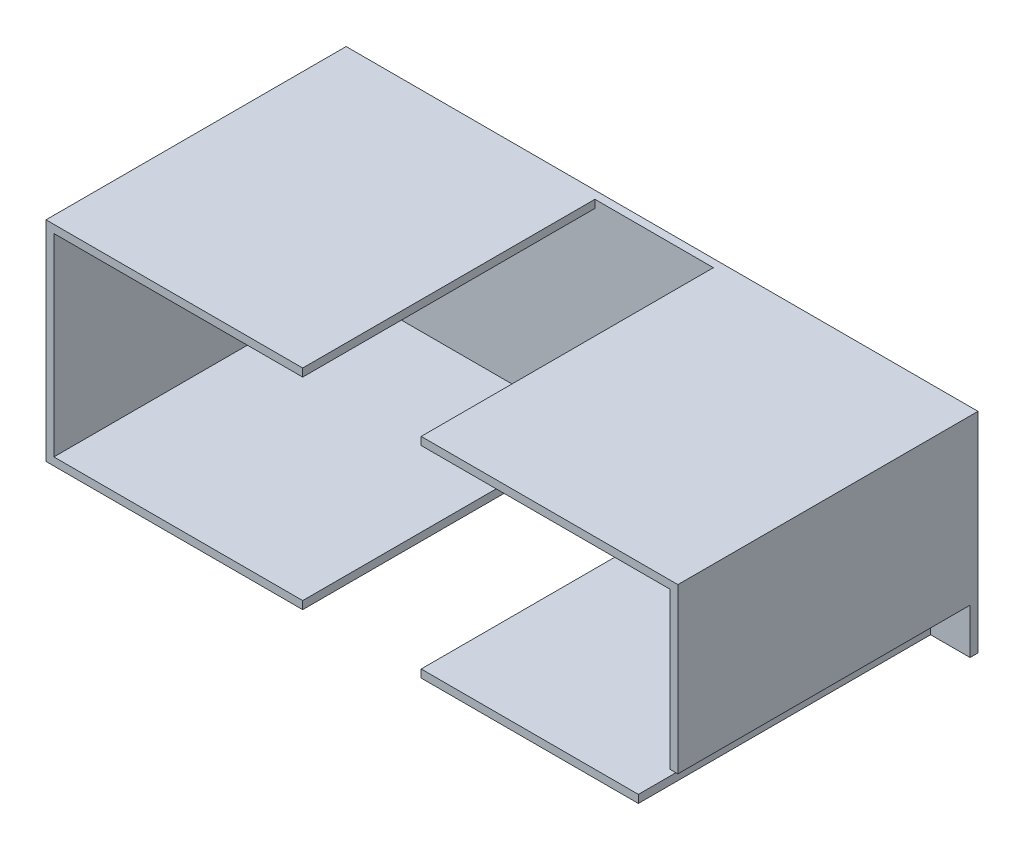
ISO-10303-21;
HEADER;
FILE_DESCRIPTION(('STEP AP214'),'2;1');
FILE_NAME('part.step','',(''),(''),'','','');
FILE_SCHEMA(('AUTOMOTIVE_DESIGN { 1 0 10303 214 1 1 1 1 }'));
ENDSEC;
DATA;
#1=APPLICATION_CONTEXT('core data for automotive mechanical design processes');
#2=APPLICATION_PROTOCOL_DEFINITION('international standard','automotive_design',2000,#1);
#3=PRODUCT_CONTEXT('',#1,'mechanical');
#4=PRODUCT('Part','Part','',(#3));
#5=PRODUCT_RELATED_PRODUCT_CATEGORY('part','',(#4));
#6=PRODUCT_DEFINITION_FORMATION('','',#4);
#7=PRODUCT_DEFINITION_CONTEXT('part definition',#1,'design');
#8=PRODUCT_DEFINITION('design','',#6,#7);
#9=PRODUCT_DEFINITION_SHAPE('','',#8);
#10=(LENGTH_UNIT() NAMED_UNIT(*) SI_UNIT(.MILLI.,.METRE.));
#11=(NAMED_UNIT(*) PLANE_ANGLE_UNIT() SI_UNIT($,.RADIAN.));
#12=(NAMED_UNIT(*) SI_UNIT($,.STERADIAN.) SOLID_ANGLE_UNIT());
#13=UNCERTAINTY_MEASURE_WITH_UNIT(LENGTH_MEASURE(1.E-05),#10,'distance_accuracy_value','');
#14=(GEOMETRIC_REPRESENTATION_CONTEXT(3) GLOBAL_UNCERTAINTY_ASSIGNED_CONTEXT((#13)) GLOBAL_UNIT_ASSIGNED_CONTEXT((#10,
#11,#12)) REPRESENTATION_CONTEXT('',''));
#15=CARTESIAN_POINT('',(0.,0.,0.));
#16=DIRECTION('',(0.,0.,1.));
#17=DIRECTION('',(1.,0.,0.));
#18=AXIS2_PLACEMENT_3D('',#15,#16,#17);
#19=CARTESIAN_POINT('',(0.,0.,76.));
#20=DIRECTION('',(0.,0.,-1.));
#21=DIRECTION('',(-1.,0.,0.));
#22=AXIS2_PLACEMENT_3D('',#19,#20,#21);
#23=PLANE('',#22);
#24=DIRECTION('',(-1.,0.,0.));
#25=VECTOR('',#24,1.);
#26=CARTESIAN_POINT('',(78.,24.5,76.));
#27=LINE('',#26,#25);
#28=CARTESIAN_POINT('',(-15.,24.5,76.));
#29=VERTEX_POINT('',#28);
#30=CARTESIAN_POINT('',(-78.,24.5,76.));
#31=VERTEX_POINT('',#30);
#32=EDGE_CURVE('E256',#29,#31,#27,.T.);
#33=ORIENTED_EDGE('',*,*,#32,.F.);
#34=DIRECTION('',(0.,-1.,0.));
#35=VECTOR('',#34,1.);
#36=CARTESIAN_POINT('',(-15.,24.5,76.));
#37=LINE('',#36,#35);
#38=CARTESIAN_POINT('',(-15.,26.5,76.));
#39=VERTEX_POINT('',#38);
#40=EDGE_CURVE('E183',#39,#29,#37,.T.);
#41=ORIENTED_EDGE('',*,*,#40,.F.);
#42=DIRECTION('',(-1.,0.,0.));
#43=VECTOR('',#42,1.);
#44=CARTESIAN_POINT('',(-80.,26.5,76.));
#45=LINE('',#44,#43);
#46=CARTESIAN_POINT('',(-80.,26.5,76.));
#47=VERTEX_POINT('',#46);
#48=EDGE_CURVE('E188',#39,#47,#45,.T.);
#49=ORIENTED_EDGE('',*,*,#48,.T.);
#50=DIRECTION('',(0.,-1.,0.));
#51=VECTOR('',#50,1.);
#52=CARTESIAN_POINT('',(-80.,-26.5,76.));
#53=LINE('',#52,#51);
#54=CARTESIAN_POINT('',(-80.,-26.5,76.));
#55=VERTEX_POINT('',#54);
#56=EDGE_CURVE('E289',#47,#55,#53,.T.);
#57=ORIENTED_EDGE('',*,*,#56,.T.);
#58=DIRECTION('',(1.,0.,0.));
#59=VECTOR('',#58,1.);
#60=CARTESIAN_POINT('',(-80.,-26.5,76.));
#61=LINE('',#60,#59);
#62=CARTESIAN_POINT('',(-15.,-26.5,76.));
#63=VERTEX_POINT('',#62);
#64=EDGE_CURVE('E292',#55,#63,#61,.T.);
#65=ORIENTED_EDGE('',*,*,#64,.T.);
#66=DIRECTION('',(0.,-1.,0.));
#67=VECTOR('',#66,1.);
#68=CARTESIAN_POINT('',(-15.,-26.5,76.));
#69=LINE('',#68,#67);
#70=CARTESIAN_POINT('',(-15.,-24.5,76.));
#71=VERTEX_POINT('',#70);
#72=EDGE_CURVE('E196',#71,#63,#69,.T.);
#73=ORIENTED_EDGE('',*,*,#72,.F.);
#74=DIRECTION('',(1.,0.,0.));
#75=VECTOR('',#74,1.);
#76=CARTESIAN_POINT('',(-78.,-24.5,76.));
#77=LINE('',#76,#75);
#78=CARTESIAN_POINT('',(-78.,-24.5,76.));
#79=VERTEX_POINT('',#78);
#80=EDGE_CURVE('E259',#79,#71,#77,.T.);
#81=ORIENTED_EDGE('',*,*,#80,.F.);
#82=DIRECTION('',(0.,-1.,0.));
#83=VECTOR('',#82,1.);
#84=CARTESIAN_POINT('',(-78.,24.5,76.));
#85=LINE('',#84,#83);
#86=EDGE_CURVE('E250',#31,#79,#85,.T.);
#87=ORIENTED_EDGE('',*,*,#86,.F.);
#88=EDGE_LOOP('',(#33,#41,#49,#57,#65,#73,#81,#87));
#89=FACE_BOUND('',#88,.T.);
#90=ADVANCED_FACE('F34',(#89),#23,.F.);
#91=CARTESIAN_POINT('',(80.,26.5,76.));
#92=VERTEX_POINT('',#91);
#93=CARTESIAN_POINT('',(15.,26.5,76.));
#94=VERTEX_POINT('',#93);
#95=EDGE_CURVE('E286',#92,#94,#45,.T.);
#96=ORIENTED_EDGE('',*,*,#95,.T.);
#97=DIRECTION('',(0.,1.,0.));
#98=VECTOR('',#97,1.);
#99=CARTESIAN_POINT('',(15.,24.5,76.));
#100=LINE('',#99,#98);
#101=CARTESIAN_POINT('',(15.,24.5,76.));
#102=VERTEX_POINT('',#101);
#103=EDGE_CURVE('E218',#102,#94,#100,.T.);
#104=ORIENTED_EDGE('',*,*,#103,.F.);
#105=CARTESIAN_POINT('',(78.,24.5,76.));
#106=VERTEX_POINT('',#105);
#107=EDGE_CURVE('E253',#106,#102,#27,.T.);
#108=ORIENTED_EDGE('',*,*,#107,.F.);
#109=DIRECTION('',(0.,1.,0.));
#110=VECTOR('',#109,1.);
#111=CARTESIAN_POINT('',(78.,-24.5,76.));
#112=LINE('',#111,#110);
#113=CARTESIAN_POINT('',(78.,-15.,76.));
#114=VERTEX_POINT('',#113);
#115=EDGE_CURVE('E257',#114,#106,#112,.T.);
#116=ORIENTED_EDGE('',*,*,#115,.F.);
#117=DIRECTION('',(-1.,0.,0.));
#118=VECTOR('',#117,1.);
#119=CARTESIAN_POINT('',(90.,-15.,76.));
#120=LINE('',#119,#118);
#121=CARTESIAN_POINT('',(80.,-15.,76.));
#122=VERTEX_POINT('',#121);
#123=EDGE_CURVE('E222',#122,#114,#120,.T.);
#124=ORIENTED_EDGE('',*,*,#123,.F.);
#125=DIRECTION('',(0.,1.,0.));
#126=VECTOR('',#125,1.);
#127=CARTESIAN_POINT('',(80.,-26.5,76.));
#128=LINE('',#127,#126);
#129=EDGE_CURVE('E283',#122,#92,#128,.T.);
#130=ORIENTED_EDGE('',*,*,#129,.T.);
#131=EDGE_LOOP('',(#96,#104,#108,#116,#124,#130));
#132=FACE_BOUND('',#131,.T.);
#133=ADVANCED_FACE('F343',(#132),#23,.F.);
#134=CARTESIAN_POINT('',(78.,24.5,-163.514525348667));
#135=DIRECTION('',(0.,1.,0.));
#136=DIRECTION('',(0.,0.,1.));
#137=AXIS2_PLACEMENT_3D('',#134,#135,#136);
#138=PLANE('',#137);
#139=DIRECTION('',(-1.,0.,0.));
#140=VECTOR('',#139,1.);
#141=CARTESIAN_POINT('',(78.,24.5,2.));
#142=LINE('',#141,#140);
#143=CARTESIAN_POINT('',(-15.,24.5,2.));
#144=VERTEX_POINT('',#143);
#145=CARTESIAN_POINT('',(-78.,24.5,2.));
#146=VERTEX_POINT('',#145);
#147=EDGE_CURVE('E276',#144,#146,#142,.T.);
#148=ORIENTED_EDGE('',*,*,#147,.F.);
#149=DIRECTION('',(0.,0.,1.));
#150=VECTOR('',#149,1.);
#151=CARTESIAN_POINT('',(-15.,24.5,-28.0665927567458));
#152=LINE('',#151,#150);
#153=EDGE_CURVE('E171',#144,#29,#152,.T.);
#154=ORIENTED_EDGE('',*,*,#153,.T.);
#155=ORIENTED_EDGE('',*,*,#32,.T.);
#156=DIRECTION('',(0.,0.,1.));
#157=VECTOR('',#156,1.);
#158=CARTESIAN_POINT('',(-78.,24.5,-163.514525348667));
#159=LINE('',#158,#157);
#160=EDGE_CURVE('E273',#146,#31,#159,.T.);
#161=ORIENTED_EDGE('',*,*,#160,.F.);
#162=EDGE_LOOP('',(#148,#154,#155,#161));
#163=FACE_BOUND('',#162,.T.);
#164=ADVANCED_FACE('F361',(#163),#138,.F.);
#165=CARTESIAN_POINT('',(-78.,-24.5,-163.514525348667));
#166=DIRECTION('',(0.,-1.,0.));
#167=DIRECTION('',(0.,0.,-1.));
#168=AXIS2_PLACEMENT_3D('',#165,#166,#167);
#169=PLANE('',#168);
#170=ORIENTED_EDGE('',*,*,#80,.T.);
#171=DIRECTION('',(0.,0.,1.));
#172=VECTOR('',#171,1.);
#173=CARTESIAN_POINT('',(-15.,-24.5,-28.0665927567458));
#174=LINE('',#173,#172);
#175=CARTESIAN_POINT('',(-15.,-24.5,2.));
#176=VERTEX_POINT('',#175);
#177=EDGE_CURVE('E198',#176,#71,#174,.T.);
#178=ORIENTED_EDGE('',*,*,#177,.F.);
#179=DIRECTION('',(1.,0.,0.));
#180=VECTOR('',#179,1.);
#181=CARTESIAN_POINT('',(-78.,-24.5,2.));
#182=LINE('',#181,#180);
#183=CARTESIAN_POINT('',(-78.,-24.5,2.));
#184=VERTEX_POINT('',#183);
#185=EDGE_CURVE('E264',#184,#176,#182,.T.);
#186=ORIENTED_EDGE('',*,*,#185,.F.);
#187=DIRECTION('',(0.,0.,1.));
#188=VECTOR('',#187,1.);
#189=CARTESIAN_POINT('',(-78.,-24.5,-163.514525348667));
#190=LINE('',#189,#188);
#191=EDGE_CURVE('E272',#184,#79,#190,.T.);
#192=ORIENTED_EDGE('',*,*,#191,.T.);
#193=EDGE_LOOP('',(#170,#178,#186,#192));
#194=FACE_BOUND('',#193,.T.);
#195=ADVANCED_FACE('F371',(#194),#169,.F.);
#196=CARTESIAN_POINT('',(80.,-26.5,76.));
#197=DIRECTION('',(-1.,0.,0.));
#198=DIRECTION('',(0.,0.,1.));
#199=AXIS2_PLACEMENT_3D('',#196,#197,#198);
#200=PLANE('',#199);
#201=DIRECTION('',(0.,0.,-1.));
#202=VECTOR('',#201,1.);
#203=CARTESIAN_POINT('',(80.,-15.,76.));
#204=LINE('',#203,#202);
#205=CARTESIAN_POINT('',(80.,-15.,2.));
#206=VERTEX_POINT('',#205);
#207=EDGE_CURVE('E234',#122,#206,#204,.T.);
#208=ORIENTED_EDGE('',*,*,#207,.T.);
#209=DIRECTION('',(0.,-1.,0.));
#210=VECTOR('',#209,1.);
#211=CARTESIAN_POINT('',(80.,-26.5,2.));
#212=LINE('',#211,#210);
#213=CARTESIAN_POINT('',(80.,-26.5,2.));
#214=VERTEX_POINT('',#213);
#215=EDGE_CURVE('E231',#206,#214,#212,.T.);
#216=ORIENTED_EDGE('',*,*,#215,.T.);
#217=DIRECTION('',(0.,0.,-1.));
#218=VECTOR('',#217,1.);
#219=CARTESIAN_POINT('',(80.,-26.5,76.));
#220=LINE('',#219,#218);
#221=CARTESIAN_POINT('',(80.,-26.5,0.));
#222=VERTEX_POINT('',#221);
#223=EDGE_CURVE('E295',#214,#222,#220,.T.);
#224=ORIENTED_EDGE('',*,*,#223,.T.);
#225=DIRECTION('',(0.,1.,0.));
#226=VECTOR('',#225,1.);
#227=CARTESIAN_POINT('',(80.,-26.5,0.));
#228=LINE('',#227,#226);
#229=CARTESIAN_POINT('',(80.,26.5,0.));
#230=VERTEX_POINT('',#229);
#231=EDGE_CURVE('E267',#222,#230,#228,.T.);
#232=ORIENTED_EDGE('',*,*,#231,.T.);
#233=DIRECTION('',(0.,0.,-1.));
#234=VECTOR('',#233,1.);
#235=CARTESIAN_POINT('',(80.,26.5,76.));
#236=LINE('',#235,#234);
#237=EDGE_CURVE('E311',#92,#230,#236,.T.);
#238=ORIENTED_EDGE('',*,*,#237,.F.);
#239=ORIENTED_EDGE('',*,*,#129,.F.);
#240=EDGE_LOOP('',(#208,#216,#224,#232,#238,#239));
#241=FACE_BOUND('',#240,.T.);
#242=ADVANCED_FACE('F36',(#241),#200,.F.);
#243=CARTESIAN_POINT('',(-80.,26.5,76.));
#244=DIRECTION('',(0.,-1.,0.));
#245=DIRECTION('',(0.,0.,-1.));
#246=AXIS2_PLACEMENT_3D('',#243,#244,#245);
#247=PLANE('',#246);
#248=ORIENTED_EDGE('',*,*,#48,.F.);
#249=DIRECTION('',(0.,0.,1.));
#250=VECTOR('',#249,1.);
#251=CARTESIAN_POINT('',(-15.,26.5,-28.0665927567458));
#252=LINE('',#251,#250);
#253=CARTESIAN_POINT('',(-15.,26.5,2.));
#254=VERTEX_POINT('',#253);
#255=EDGE_CURVE('E168',#254,#39,#252,.T.);
#256=ORIENTED_EDGE('',*,*,#255,.F.);
#257=DIRECTION('',(-1.,0.,0.));
#258=VECTOR('',#257,1.);
#259=CARTESIAN_POINT('',(-15.,26.5,2.));
#260=LINE('',#259,#258);
#261=CARTESIAN_POINT('',(15.,26.5,2.));
#262=VERTEX_POINT('',#261);
#263=EDGE_CURVE('E176',#262,#254,#260,.T.);
#264=ORIENTED_EDGE('',*,*,#263,.F.);
#265=DIRECTION('',(0.,0.,1.));
#266=VECTOR('',#265,1.);
#267=CARTESIAN_POINT('',(15.,26.5,-28.0665927567458));
#268=LINE('',#267,#266);
#269=EDGE_CURVE('E193',#262,#94,#268,.T.);
#270=ORIENTED_EDGE('',*,*,#269,.T.);
#271=ORIENTED_EDGE('',*,*,#95,.F.);
#272=ORIENTED_EDGE('',*,*,#237,.T.);
#273=DIRECTION('',(-1.,0.,0.));
#274=VECTOR('',#273,1.);
#275=CARTESIAN_POINT('',(-80.,26.5,0.));
#276=LINE('',#275,#274);
#277=CARTESIAN_POINT('',(-80.,26.5,0.));
#278=VERTEX_POINT('',#277);
#279=EDGE_CURVE('E298',#230,#278,#276,.T.);
#280=ORIENTED_EDGE('',*,*,#279,.T.);
#281=DIRECTION('',(0.,0.,-1.));
#282=VECTOR('',#281,1.);
#283=CARTESIAN_POINT('',(-80.,26.5,76.));
#284=LINE('',#283,#282);
#285=EDGE_CURVE('E308',#47,#278,#284,.T.);
#286=ORIENTED_EDGE('',*,*,#285,.F.);
#287=EDGE_LOOP('',(#248,#256,#264,#270,#271,#272,#280,#286));
#288=FACE_BOUND('',#287,.T.);
#289=ADVANCED_FACE('F186',(#288),#247,.F.);
#290=CARTESIAN_POINT('',(-80.,-26.5,76.));
#291=DIRECTION('',(1.,0.,0.));
#292=DIRECTION('',(0.,0.,-1.));
#293=AXIS2_PLACEMENT_3D('',#290,#291,#292);
#294=PLANE('',#293);
#295=DIRECTION('',(0.,-1.,0.));
#296=VECTOR('',#295,1.);
#297=CARTESIAN_POINT('',(-80.,-26.5,0.));
#298=LINE('',#297,#296);
#299=CARTESIAN_POINT('',(-80.,-26.5,0.));
#300=VERTEX_POINT('',#299);
#301=EDGE_CURVE('E300',#278,#300,#298,.T.);
#302=ORIENTED_EDGE('',*,*,#301,.T.);
#303=DIRECTION('',(0.,0.,-1.));
#304=VECTOR('',#303,1.);
#305=CARTESIAN_POINT('',(-80.,-26.5,76.));
#306=LINE('',#305,#304);
#307=EDGE_CURVE('E305',#55,#300,#306,.T.);
#308=ORIENTED_EDGE('',*,*,#307,.F.);
#309=ORIENTED_EDGE('',*,*,#56,.F.);
#310=ORIENTED_EDGE('',*,*,#285,.T.);
#311=EDGE_LOOP('',(#302,#308,#309,#310));
#312=FACE_BOUND('',#311,.T.);
#313=ADVANCED_FACE('F378',(#312),#294,.F.);
#314=CARTESIAN_POINT('',(-80.,-26.5,76.));
#315=DIRECTION('',(0.,1.,0.));
#316=DIRECTION('',(0.,0.,1.));
#317=AXIS2_PLACEMENT_3D('',#314,#315,#316);
#318=PLANE('',#317);
#319=DIRECTION('',(1.,0.,0.));
#320=VECTOR('',#319,1.);
#321=CARTESIAN_POINT('',(-15.,-26.5,2.));
#322=LINE('',#321,#320);
#323=CARTESIAN_POINT('',(-15.,-26.5,2.));
#324=VERTEX_POINT('',#323);
#325=CARTESIAN_POINT('',(15.,-26.5,2.));
#326=VERTEX_POINT('',#325);
#327=EDGE_CURVE('E205',#324,#326,#322,.T.);
#328=ORIENTED_EDGE('',*,*,#327,.F.);
#329=DIRECTION('',(0.,0.,1.));
#330=VECTOR('',#329,1.);
#331=CARTESIAN_POINT('',(-15.,-26.5,-28.0665927567458));
#332=LINE('',#331,#330);
#333=EDGE_CURVE('E208',#324,#63,#332,.T.);
#334=ORIENTED_EDGE('',*,*,#333,.T.);
#335=ORIENTED_EDGE('',*,*,#64,.F.);
#336=ORIENTED_EDGE('',*,*,#307,.T.);
#337=DIRECTION('',(1.,0.,0.));
#338=VECTOR('',#337,1.);
#339=CARTESIAN_POINT('',(-80.,-26.5,0.));
#340=LINE('',#339,#338);
#341=EDGE_CURVE('E285',#300,#222,#340,.T.);
#342=ORIENTED_EDGE('',*,*,#341,.T.);
#343=ORIENTED_EDGE('',*,*,#223,.F.);
#344=DIRECTION('',(-1.,0.,0.));
#345=VECTOR('',#344,1.);
#346=CARTESIAN_POINT('',(-80.,-26.5,2.));
#347=LINE('',#346,#345);
#348=CARTESIAN_POINT('',(70.,-26.5,2.));
#349=VERTEX_POINT('',#348);
#350=EDGE_CURVE('E228',#214,#349,#347,.T.);
#351=ORIENTED_EDGE('',*,*,#350,.T.);
#352=DIRECTION('',(0.,0.,1.));
#353=VECTOR('',#352,1.);
#354=CARTESIAN_POINT('',(70.,-26.5,76.));
#355=LINE('',#354,#353);
#356=CARTESIAN_POINT('',(70.,-26.5,76.));
#357=VERTEX_POINT('',#356);
#358=EDGE_CURVE('E195',#349,#357,#355,.T.);
#359=ORIENTED_EDGE('',*,*,#358,.T.);
#360=CARTESIAN_POINT('',(15.,-26.5,76.));
#361=VERTEX_POINT('',#360);
#362=EDGE_CURVE('E291',#361,#357,#61,.T.);
#363=ORIENTED_EDGE('',*,*,#362,.F.);
#364=DIRECTION('',(0.,0.,1.));
#365=VECTOR('',#364,1.);
#366=CARTESIAN_POINT('',(15.,-26.5,-28.0665927567458));
#367=LINE('',#366,#365);
#368=EDGE_CURVE('E204',#326,#361,#367,.T.);
#369=ORIENTED_EDGE('',*,*,#368,.F.);
#370=EDGE_LOOP('',(#328,#334,#335,#336,#342,#343,#351,#359,#363,#369));
#371=FACE_BOUND('',#370,.T.);
#372=ADVANCED_FACE('F332',(#371),#318,.F.);
#373=CARTESIAN_POINT('',(15.,-24.5,76.));
#374=VERTEX_POINT('',#373);
#375=CARTESIAN_POINT('',(70.,-24.5,76.));
#376=VERTEX_POINT('',#375);
#377=EDGE_CURVE('E241',#374,#376,#77,.T.);
#378=ORIENTED_EDGE('',*,*,#377,.F.);
#379=DIRECTION('',(0.,1.,0.));
#380=VECTOR('',#379,1.);
#381=CARTESIAN_POINT('',(15.,-26.5,76.));
#382=LINE('',#381,#380);
#383=EDGE_CURVE('E199',#361,#374,#382,.T.);
#384=ORIENTED_EDGE('',*,*,#383,.F.);
#385=ORIENTED_EDGE('',*,*,#362,.T.);
#386=DIRECTION('',(0.,-1.,0.));
#387=VECTOR('',#386,1.);
#388=CARTESIAN_POINT('',(70.,-15.,76.));
#389=LINE('',#388,#387);
#390=EDGE_CURVE('E219',#376,#357,#389,.T.);
#391=ORIENTED_EDGE('',*,*,#390,.F.);
#392=EDGE_LOOP('',(#378,#384,#385,#391));
#393=FACE_BOUND('',#392,.T.);
#394=ADVANCED_FACE('F327',(#393),#23,.F.);
#395=CARTESIAN_POINT('',(0.,0.,0.));
#396=DIRECTION('',(0.,0.,-1.));
#397=DIRECTION('',(-1.,0.,0.));
#398=AXIS2_PLACEMENT_3D('',#395,#396,#397);
#399=PLANE('',#398);
#400=CARTESIAN_POINT('',(50.,0.,0.));
#401=DIRECTION('',(0.,0.,-1.));
#402=DIRECTION('',(-1.,0.,0.));
#403=AXIS2_PLACEMENT_3D('',#400,#401,#402);
#404=CIRCLE('',#403,2.);
#405=CARTESIAN_POINT('',(48.,0.,0.));
#406=VERTEX_POINT('',#405);
#407=EDGE_CURVE('E242',#406,#406,#404,.F.);
#408=ORIENTED_EDGE('',*,*,#407,.T.);
#409=EDGE_LOOP('',(#408));
#410=FACE_BOUND('',#409,.T.);
#411=CARTESIAN_POINT('',(-50.,0.,0.));
#412=DIRECTION('',(0.,0.,-1.));
#413=DIRECTION('',(-1.,0.,0.));
#414=AXIS2_PLACEMENT_3D('',#411,#412,#413);
#415=CIRCLE('',#414,2.);
#416=CARTESIAN_POINT('',(-52.,0.,0.));
#417=VERTEX_POINT('',#416);
#418=EDGE_CURVE('E237',#417,#417,#415,.F.);
#419=ORIENTED_EDGE('',*,*,#418,.T.);
#420=EDGE_LOOP('',(#419));
#421=FACE_BOUND('',#420,.T.);
#422=ORIENTED_EDGE('',*,*,#231,.F.);
#423=ORIENTED_EDGE('',*,*,#341,.F.);
#424=ORIENTED_EDGE('',*,*,#301,.F.);
#425=ORIENTED_EDGE('',*,*,#279,.F.);
#426=EDGE_LOOP('',(#422,#423,#424,#425));
#427=FACE_BOUND('',#426,.T.);
#428=ADVANCED_FACE('F383',(#410,#421,#427),#399,.T.);
#429=CARTESIAN_POINT('',(0.,0.,2.));
#430=DIRECTION('',(0.,0.,-1.));
#431=DIRECTION('',(-1.,0.,0.));
#432=AXIS2_PLACEMENT_3D('',#429,#430,#431);
#433=PLANE('',#432);
#434=DIRECTION('',(-1.,0.,0.));
#435=VECTOR('',#434,1.);
#436=CARTESIAN_POINT('',(90.,-15.,2.));
#437=LINE('',#436,#435);
#438=CARTESIAN_POINT('',(78.,-15.,2.));
#439=VERTEX_POINT('',#438);
#440=EDGE_CURVE('E221',#206,#439,#437,.T.);
#441=ORIENTED_EDGE('',*,*,#440,.T.);
#442=DIRECTION('',(0.,1.,0.));
#443=VECTOR('',#442,1.);
#444=CARTESIAN_POINT('',(78.,-24.5,2.));
#445=LINE('',#444,#443);
#446=CARTESIAN_POINT('',(78.,24.5,2.));
#447=VERTEX_POINT('',#446);
#448=EDGE_CURVE('E252',#439,#447,#445,.T.);
#449=ORIENTED_EDGE('',*,*,#448,.T.);
#450=CARTESIAN_POINT('',(15.,24.5,2.));
#451=VERTEX_POINT('',#450);
#452=EDGE_CURVE('E274',#447,#451,#142,.T.);
#453=ORIENTED_EDGE('',*,*,#452,.T.);
#454=DIRECTION('',(0.,1.,0.));
#455=VECTOR('',#454,1.);
#456=CARTESIAN_POINT('',(15.,24.5,2.));
#457=LINE('',#456,#455);
#458=EDGE_CURVE('E49',#451,#262,#457,.T.);
#459=ORIENTED_EDGE('',*,*,#458,.T.);
#460=ORIENTED_EDGE('',*,*,#263,.T.);
#461=DIRECTION('',(0.,-1.,0.));
#462=VECTOR('',#461,1.);
#463=CARTESIAN_POINT('',(-15.,24.5,2.));
#464=LINE('',#463,#462);
#465=EDGE_CURVE('E164',#254,#144,#464,.T.);
#466=ORIENTED_EDGE('',*,*,#465,.T.);
#467=ORIENTED_EDGE('',*,*,#147,.T.);
#468=DIRECTION('',(0.,-1.,0.));
#469=VECTOR('',#468,1.);
#470=CARTESIAN_POINT('',(-78.,24.5,2.));
#471=LINE('',#470,#469);
#472=EDGE_CURVE('E269',#146,#184,#471,.T.);
#473=ORIENTED_EDGE('',*,*,#472,.T.);
#474=ORIENTED_EDGE('',*,*,#185,.T.);
#475=DIRECTION('',(0.,-1.,0.));
#476=VECTOR('',#475,1.);
#477=CARTESIAN_POINT('',(-15.,-26.5,2.));
#478=LINE('',#477,#476);
#479=EDGE_CURVE('E209',#176,#324,#478,.T.);
#480=ORIENTED_EDGE('',*,*,#479,.T.);
#481=ORIENTED_EDGE('',*,*,#327,.T.);
#482=DIRECTION('',(0.,1.,0.));
#483=VECTOR('',#482,1.);
#484=CARTESIAN_POINT('',(15.,-26.5,2.));
#485=LINE('',#484,#483);
#486=CARTESIAN_POINT('',(15.,-24.5,2.));
#487=VERTEX_POINT('',#486);
#488=EDGE_CURVE('E201',#326,#487,#485,.T.);
#489=ORIENTED_EDGE('',*,*,#488,.T.);
#490=CARTESIAN_POINT('',(70.,-24.5,2.));
#491=VERTEX_POINT('',#490);
#492=EDGE_CURVE('E268',#487,#491,#182,.T.);
#493=ORIENTED_EDGE('',*,*,#492,.T.);
#494=DIRECTION('',(0.,-1.,0.));
#495=VECTOR('',#494,1.);
#496=CARTESIAN_POINT('',(70.,-15.,2.));
#497=LINE('',#496,#495);
#498=EDGE_CURVE('E57',#491,#349,#497,.T.);
#499=ORIENTED_EDGE('',*,*,#498,.T.);
#500=ORIENTED_EDGE('',*,*,#350,.F.);
#501=ORIENTED_EDGE('',*,*,#215,.F.);
#502=EDGE_LOOP('',(#441,#449,#453,#459,#460,#466,#467,#473,#474,#480,#481,#489,#493,#499,#500,#501));
#503=FACE_BOUND('',#502,.T.);
#504=CARTESIAN_POINT('',(50.,0.,2.));
#505=DIRECTION('',(0.,0.,1.));
#506=DIRECTION('',(1.,0.,0.));
#507=AXIS2_PLACEMENT_3D('',#504,#505,#506);
#508=CIRCLE('',#507,2.);
#509=CARTESIAN_POINT('',(52.,0.,2.));
#510=VERTEX_POINT('',#509);
#511=EDGE_CURVE('E238',#510,#510,#508,.T.);
#512=ORIENTED_EDGE('',*,*,#511,.F.);
#513=EDGE_LOOP('',(#512));
#514=FACE_BOUND('',#513,.T.);
#515=CARTESIAN_POINT('',(-50.,0.,2.));
#516=DIRECTION('',(0.,0.,1.));
#517=DIRECTION('',(1.,0.,0.));
#518=AXIS2_PLACEMENT_3D('',#515,#516,#517);
#519=CIRCLE('',#518,2.);
#520=CARTESIAN_POINT('',(-48.,0.,2.));
#521=VERTEX_POINT('',#520);
#522=EDGE_CURVE('E245',#521,#521,#519,.T.);
#523=ORIENTED_EDGE('',*,*,#522,.F.);
#524=EDGE_LOOP('',(#523));
#525=FACE_BOUND('',#524,.T.);
#526=ADVANCED_FACE('F178',(#503,#514,#525),#433,.F.);
#527=CARTESIAN_POINT('',(78.,-24.5,-163.514525348667));
#528=DIRECTION('',(1.,0.,0.));
#529=DIRECTION('',(0.,0.,-1.));
#530=AXIS2_PLACEMENT_3D('',#527,#528,#529);
#531=PLANE('',#530);
#532=ORIENTED_EDGE('',*,*,#448,.F.);
#533=DIRECTION('',(0.,0.,1.));
#534=VECTOR('',#533,1.);
#535=CARTESIAN_POINT('',(78.,-15.,-163.514525348667));
#536=LINE('',#535,#534);
#537=EDGE_CURVE('E12',#439,#114,#536,.T.);
#538=ORIENTED_EDGE('',*,*,#537,.T.);
#539=ORIENTED_EDGE('',*,*,#115,.T.);
#540=DIRECTION('',(0.,0.,1.));
#541=VECTOR('',#540,1.);
#542=CARTESIAN_POINT('',(78.,24.5,-163.514525348667));
#543=LINE('',#542,#541);
#544=EDGE_CURVE('E263',#447,#106,#543,.T.);
#545=ORIENTED_EDGE('',*,*,#544,.F.);
#546=EDGE_LOOP('',(#532,#538,#539,#545));
#547=FACE_BOUND('',#546,.T.);
#548=ADVANCED_FACE('F350',(#547),#531,.F.);
#549=ORIENTED_EDGE('',*,*,#107,.T.);
#550=DIRECTION('',(0.,0.,1.));
#551=VECTOR('',#550,1.);
#552=CARTESIAN_POINT('',(15.,24.5,-28.0665927567458));
#553=LINE('',#552,#551);
#554=EDGE_CURVE('E354',#451,#102,#553,.T.);
#555=ORIENTED_EDGE('',*,*,#554,.F.);
#556=ORIENTED_EDGE('',*,*,#452,.F.);
#557=ORIENTED_EDGE('',*,*,#544,.T.);
#558=EDGE_LOOP('',(#549,#555,#556,#557));
#559=FACE_BOUND('',#558,.T.);
#560=ADVANCED_FACE('F353',(#559),#138,.F.);
#561=CARTESIAN_POINT('',(-78.,24.5,-163.514525348667));
#562=DIRECTION('',(-1.,0.,0.));
#563=DIRECTION('',(0.,0.,1.));
#564=AXIS2_PLACEMENT_3D('',#561,#562,#563);
#565=PLANE('',#564);
#566=ORIENTED_EDGE('',*,*,#160,.T.);
#567=ORIENTED_EDGE('',*,*,#86,.T.);
#568=ORIENTED_EDGE('',*,*,#191,.F.);
#569=ORIENTED_EDGE('',*,*,#472,.F.);
#570=EDGE_LOOP('',(#566,#567,#568,#569));
#571=FACE_BOUND('',#570,.T.);
#572=ADVANCED_FACE('F368',(#571),#565,.F.);
#573=ORIENTED_EDGE('',*,*,#492,.F.);
#574=DIRECTION('',(0.,0.,1.));
#575=VECTOR('',#574,1.);
#576=CARTESIAN_POINT('',(15.,-24.5,-28.0665927567458));
#577=LINE('',#576,#575);
#578=EDGE_CURVE('E203',#487,#374,#577,.T.);
#579=ORIENTED_EDGE('',*,*,#578,.T.);
#580=ORIENTED_EDGE('',*,*,#377,.T.);
#581=DIRECTION('',(0.,0.,-1.));
#582=VECTOR('',#581,1.);
#583=CARTESIAN_POINT('',(70.,-24.5,-163.514525348667));
#584=LINE('',#583,#582);
#585=EDGE_CURVE('E42',#376,#491,#584,.T.);
#586=ORIENTED_EDGE('',*,*,#585,.T.);
#587=EDGE_LOOP('',(#573,#579,#580,#586));
#588=FACE_BOUND('',#587,.T.);
#589=ADVANCED_FACE('F317',(#588),#169,.F.);
#590=CARTESIAN_POINT('',(-50.,0.,-0.00100000000000013));
#591=DIRECTION('',(0.,0.,1.));
#592=DIRECTION('',(1.,0.,0.));
#593=AXIS2_PLACEMENT_3D('',#590,#591,#592);
#594=CYLINDRICAL_SURFACE('',#593,2.);
#595=ORIENTED_EDGE('',*,*,#418,.F.);
#596=EDGE_LOOP('',(#595));
#597=FACE_BOUND('',#596,.T.);
#598=ORIENTED_EDGE('',*,*,#522,.T.);
#599=EDGE_LOOP('',(#598));
#600=FACE_BOUND('',#599,.T.);
#601=ADVANCED_FACE('F424',(#597,#600),#594,.F.);
#602=CARTESIAN_POINT('',(50.,0.,-0.00100000000000013));
#603=DIRECTION('',(0.,0.,1.));
#604=DIRECTION('',(1.,0.,0.));
#605=AXIS2_PLACEMENT_3D('',#602,#603,#604);
#606=CYLINDRICAL_SURFACE('',#605,2.);
#607=ORIENTED_EDGE('',*,*,#407,.F.);
#608=EDGE_LOOP('',(#607));
#609=FACE_BOUND('',#608,.T.);
#610=ORIENTED_EDGE('',*,*,#511,.T.);
#611=EDGE_LOOP('',(#610));
#612=FACE_BOUND('',#611,.T.);
#613=ADVANCED_FACE('F429',(#609,#612),#606,.F.);
#614=CARTESIAN_POINT('',(90.,-15.,-28.0665927567458));
#615=DIRECTION('',(0.,1.,0.));
#616=DIRECTION('',(-1.,0.,0.));
#617=AXIS2_PLACEMENT_3D('',#614,#615,#616);
#618=PLANE('',#617);
#619=ORIENTED_EDGE('',*,*,#123,.T.);
#620=ORIENTED_EDGE('',*,*,#537,.F.);
#621=ORIENTED_EDGE('',*,*,#440,.F.);
#622=ORIENTED_EDGE('',*,*,#207,.F.);
#623=EDGE_LOOP('',(#619,#620,#621,#622));
#624=FACE_BOUND('',#623,.T.);
#625=ADVANCED_FACE('F340',(#624),#618,.F.);
#626=CARTESIAN_POINT('',(70.,-15.,-28.0665927567458));
#627=DIRECTION('',(-1.,0.,0.));
#628=DIRECTION('',(0.,0.,1.));
#629=AXIS2_PLACEMENT_3D('',#626,#627,#628);
#630=PLANE('',#629);
#631=ORIENTED_EDGE('',*,*,#498,.F.);
#632=ORIENTED_EDGE('',*,*,#585,.F.);
#633=ORIENTED_EDGE('',*,*,#390,.T.);
#634=ORIENTED_EDGE('',*,*,#358,.F.);
#635=EDGE_LOOP('',(#631,#632,#633,#634));
#636=FACE_BOUND('',#635,.T.);
#637=ADVANCED_FACE('F330',(#636),#630,.F.);
#638=CARTESIAN_POINT('',(-15.,-26.5,-28.0665927567458));
#639=DIRECTION('',(-1.,0.,0.));
#640=DIRECTION('',(0.,0.,1.));
#641=AXIS2_PLACEMENT_3D('',#638,#639,#640);
#642=PLANE('',#641);
#643=ORIENTED_EDGE('',*,*,#177,.T.);
#644=ORIENTED_EDGE('',*,*,#72,.T.);
#645=ORIENTED_EDGE('',*,*,#333,.F.);
#646=ORIENTED_EDGE('',*,*,#479,.F.);
#647=EDGE_LOOP('',(#643,#644,#645,#646));
#648=FACE_BOUND('',#647,.T.);
#649=ADVANCED_FACE('F473',(#648),#642,.F.);
#650=CARTESIAN_POINT('',(15.,-26.5,-28.0665927567458));
#651=DIRECTION('',(1.,0.,0.));
#652=DIRECTION('',(0.,0.,-1.));
#653=AXIS2_PLACEMENT_3D('',#650,#651,#652);
#654=PLANE('',#653);
#655=ORIENTED_EDGE('',*,*,#368,.T.);
#656=ORIENTED_EDGE('',*,*,#383,.T.);
#657=ORIENTED_EDGE('',*,*,#578,.F.);
#658=ORIENTED_EDGE('',*,*,#488,.F.);
#659=EDGE_LOOP('',(#655,#656,#657,#658));
#660=FACE_BOUND('',#659,.T.);
#661=ADVANCED_FACE('F324',(#660),#654,.F.);
#662=CARTESIAN_POINT('',(-15.,24.5,-28.0665927567458));
#663=DIRECTION('',(-1.,0.,0.));
#664=DIRECTION('',(0.,0.,1.));
#665=AXIS2_PLACEMENT_3D('',#662,#663,#664);
#666=PLANE('',#665);
#667=ORIENTED_EDGE('',*,*,#255,.T.);
#668=ORIENTED_EDGE('',*,*,#40,.T.);
#669=ORIENTED_EDGE('',*,*,#153,.F.);
#670=ORIENTED_EDGE('',*,*,#465,.F.);
#671=EDGE_LOOP('',(#667,#668,#669,#670));
#672=FACE_BOUND('',#671,.T.);
#673=ADVANCED_FACE('F166',(#672),#666,.F.);
#674=CARTESIAN_POINT('',(15.,24.5,-28.0665927567458));
#675=DIRECTION('',(1.,0.,0.));
#676=DIRECTION('',(0.,0.,-1.));
#677=AXIS2_PLACEMENT_3D('',#674,#675,#676);
#678=PLANE('',#677);
#679=ORIENTED_EDGE('',*,*,#554,.T.);
#680=ORIENTED_EDGE('',*,*,#103,.T.);
#681=ORIENTED_EDGE('',*,*,#269,.F.);
#682=ORIENTED_EDGE('',*,*,#458,.F.);
#683=EDGE_LOOP('',(#679,#680,#681,#682));
#684=FACE_BOUND('',#683,.T.);
#685=ADVANCED_FACE('F384',(#684),#678,.F.);
#686=CLOSED_SHELL('',(#90,#133,#164,#195,#242,#289,#313,#372,#394,#428,#526,#548,#560,#572,#589,
#601,#613,#625,#637,#649,#661,#673,#685));
#687=MANIFOLD_SOLID_BREP('B2',#686);
#688=ADVANCED_BREP_SHAPE_REPRESENTATION('',(#18,#687),#14);
#689=SHAPE_DEFINITION_REPRESENTATION(#9,#688);
ENDSEC;
END-ISO-10303-21;
